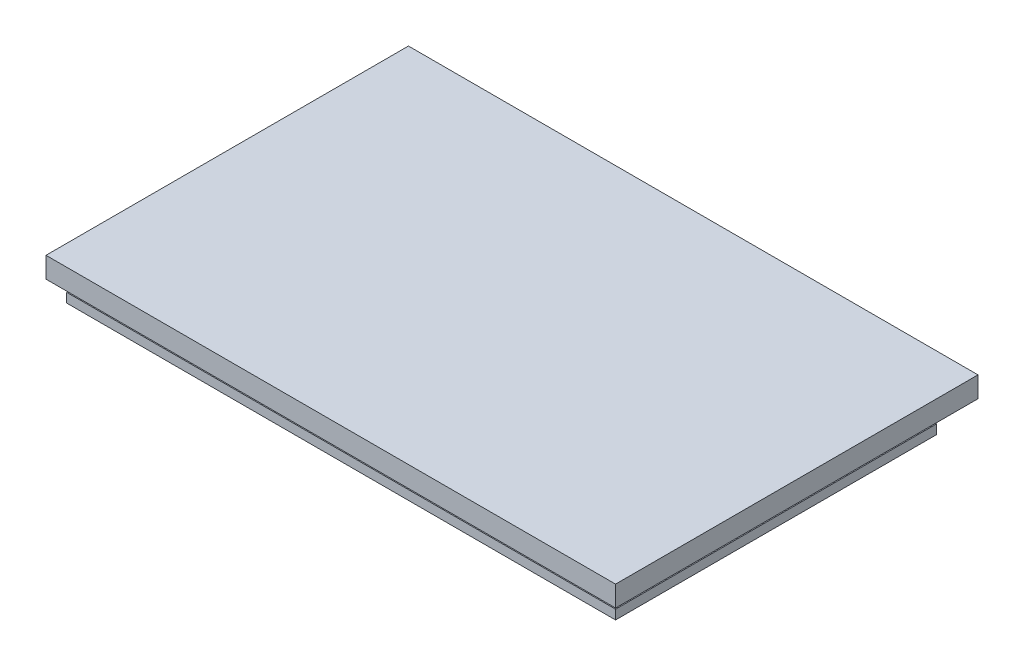
ISO-10303-21;
HEADER;
FILE_DESCRIPTION(('STEP AP214'),'2;1');
FILE_NAME('part.step','',(''),(''),'','','');
FILE_SCHEMA(('AUTOMOTIVE_DESIGN { 1 0 10303 214 1 1 1 1 }'));
ENDSEC;
DATA;
#1=APPLICATION_CONTEXT('core data for automotive mechanical design processes');
#2=APPLICATION_PROTOCOL_DEFINITION('international standard','automotive_design',2000,#1);
#3=PRODUCT_CONTEXT('',#1,'mechanical');
#4=PRODUCT('Part','Part','',(#3));
#5=PRODUCT_RELATED_PRODUCT_CATEGORY('part','',(#4));
#6=PRODUCT_DEFINITION_FORMATION('','',#4);
#7=PRODUCT_DEFINITION_CONTEXT('part definition',#1,'design');
#8=PRODUCT_DEFINITION('design','',#6,#7);
#9=PRODUCT_DEFINITION_SHAPE('','',#8);
#10=(LENGTH_UNIT() NAMED_UNIT(*) SI_UNIT(.MILLI.,.METRE.));
#11=(NAMED_UNIT(*) PLANE_ANGLE_UNIT() SI_UNIT($,.RADIAN.));
#12=(NAMED_UNIT(*) SI_UNIT($,.STERADIAN.) SOLID_ANGLE_UNIT());
#13=UNCERTAINTY_MEASURE_WITH_UNIT(LENGTH_MEASURE(1.E-05),#10,'distance_accuracy_value','');
#14=(GEOMETRIC_REPRESENTATION_CONTEXT(3) GLOBAL_UNCERTAINTY_ASSIGNED_CONTEXT((#13)) GLOBAL_UNIT_ASSIGNED_CONTEXT((#10,
#11,#12)) REPRESENTATION_CONTEXT('',''));
#15=CARTESIAN_POINT('',(0.,0.,0.));
#16=DIRECTION('',(0.,0.,1.));
#17=DIRECTION('',(1.,0.,0.));
#18=AXIS2_PLACEMENT_3D('',#15,#16,#17);
#19=CARTESIAN_POINT('',(4.92679663840367,2.286,-27.3028437938881));
#20=DIRECTION('',(1.,0.,0.));
#21=DIRECTION('',(0.,0.,-1.));
#22=AXIS2_PLACEMENT_3D('',#19,#20,#21);
#23=PLANE('',#22);
#24=DIRECTION('',(0.,0.,1.));
#25=VECTOR('',#24,1.);
#26=CARTESIAN_POINT('',(4.92679663840367,0.,-27.3028437938881));
#27=LINE('',#26,#25);
#28=CARTESIAN_POINT('',(4.92679663840367,0.,-27.3028437938881));
#29=VERTEX_POINT('',#28);
#30=CARTESIAN_POINT('',(4.92679663840368,0.,51.4371562061119));
#31=VERTEX_POINT('',#30);
#32=EDGE_CURVE('E197',#29,#31,#27,.T.);
#33=ORIENTED_EDGE('',*,*,#32,.T.);
#34=DIRECTION('',(0.,-1.,0.));
#35=VECTOR('',#34,1.);
#36=CARTESIAN_POINT('',(4.92679663840368,2.286,51.4371562061119));
#37=LINE('',#36,#35);
#38=CARTESIAN_POINT('',(4.92679663840368,2.286,51.4371562061119));
#39=VERTEX_POINT('',#38);
#40=EDGE_CURVE('E11',#39,#31,#37,.T.);
#41=ORIENTED_EDGE('',*,*,#40,.F.);
#42=DIRECTION('',(0.,0.,1.));
#43=VECTOR('',#42,1.);
#44=CARTESIAN_POINT('',(4.92679663840367,2.286,-27.3028437938881));
#45=LINE('',#44,#43);
#46=CARTESIAN_POINT('',(4.92679663840368,2.286,46.3571562061119));
#47=VERTEX_POINT('',#46);
#48=EDGE_CURVE('E202',#47,#39,#45,.T.);
#49=ORIENTED_EDGE('',*,*,#48,.F.);
#50=DIRECTION('',(0.,-1.,0.));
#51=VECTOR('',#50,1.);
#52=CARTESIAN_POINT('',(4.92679663840368,7.62,46.3571562061119));
#53=LINE('',#52,#51);
#54=CARTESIAN_POINT('',(4.92679663840368,7.62,46.3571562061119));
#55=VERTEX_POINT('',#54);
#56=EDGE_CURVE('E193',#55,#47,#53,.T.);
#57=ORIENTED_EDGE('',*,*,#56,.F.);
#58=DIRECTION('',(0.,0.,1.));
#59=VECTOR('',#58,1.);
#60=CARTESIAN_POINT('',(4.92679663840366,7.62,-32.3828437938881));
#61=LINE('',#60,#59);
#62=CARTESIAN_POINT('',(4.92679663840367,7.62,56.5171562061119));
#63=VERTEX_POINT('',#62);
#64=EDGE_CURVE('E153',#55,#63,#61,.T.);
#65=ORIENTED_EDGE('',*,*,#64,.T.);
#66=DIRECTION('',(0.,-1.,0.));
#67=VECTOR('',#66,1.);
#68=CARTESIAN_POINT('',(4.92679663840367,12.7,56.5171562061119));
#69=LINE('',#68,#67);
#70=CARTESIAN_POINT('',(4.92679663840367,12.7,56.5171562061119));
#71=VERTEX_POINT('',#70);
#72=EDGE_CURVE('E131',#71,#63,#69,.T.);
#73=ORIENTED_EDGE('',*,*,#72,.F.);
#74=DIRECTION('',(0.,0.,1.));
#75=VECTOR('',#74,1.);
#76=CARTESIAN_POINT('',(4.92679663840366,12.7,-32.3828437938881));
#77=LINE('',#76,#75);
#78=CARTESIAN_POINT('',(4.92679663840366,12.7,-32.3828437938881));
#79=VERTEX_POINT('',#78);
#80=EDGE_CURVE('E138',#79,#71,#77,.T.);
#81=ORIENTED_EDGE('',*,*,#80,.F.);
#82=DIRECTION('',(0.,-1.,0.));
#83=VECTOR('',#82,1.);
#84=CARTESIAN_POINT('',(4.92679663840366,12.7,-32.3828437938881));
#85=LINE('',#84,#83);
#86=CARTESIAN_POINT('',(4.92679663840366,7.62,-32.3828437938881));
#87=VERTEX_POINT('',#86);
#88=EDGE_CURVE('E277',#79,#87,#85,.T.);
#89=ORIENTED_EDGE('',*,*,#88,.T.);
#90=CARTESIAN_POINT('',(4.92679663840366,7.62,-22.2228437938881));
#91=VERTEX_POINT('',#90);
#92=EDGE_CURVE('E264',#87,#91,#61,.T.);
#93=ORIENTED_EDGE('',*,*,#92,.T.);
#94=DIRECTION('',(0.,-1.,0.));
#95=VECTOR('',#94,1.);
#96=CARTESIAN_POINT('',(4.92679663840367,7.62,-22.2228437938881));
#97=LINE('',#96,#95);
#98=CARTESIAN_POINT('',(4.92679663840368,2.286,-22.2228437938881));
#99=VERTEX_POINT('',#98);
#100=EDGE_CURVE('E176',#91,#99,#97,.T.);
#101=ORIENTED_EDGE('',*,*,#100,.T.);
#102=CARTESIAN_POINT('',(4.92679663840367,2.286,-27.3028437938881));
#103=VERTEX_POINT('',#102);
#104=EDGE_CURVE('E198',#103,#99,#45,.T.);
#105=ORIENTED_EDGE('',*,*,#104,.F.);
#106=DIRECTION('',(0.,-1.,0.));
#107=VECTOR('',#106,1.);
#108=CARTESIAN_POINT('',(4.92679663840367,2.286,-27.3028437938881));
#109=LINE('',#108,#107);
#110=EDGE_CURVE('E211',#103,#29,#109,.T.);
#111=ORIENTED_EDGE('',*,*,#110,.T.);
#112=EDGE_LOOP('',(#33,#41,#49,#57,#65,#73,#81,#89,#93,#101,#105,#111));
#113=FACE_BOUND('',#112,.T.);
#114=ADVANCED_FACE('F39',(#113),#23,.F.);
#115=CARTESIAN_POINT('',(4.92679663840368,2.286,51.4371562061119));
#116=DIRECTION('',(0.,0.,-1.));
#117=DIRECTION('',(-1.,0.,0.));
#118=AXIS2_PLACEMENT_3D('',#115,#116,#117);
#119=PLANE('',#118);
#120=DIRECTION('',(1.,0.,0.));
#121=VECTOR('',#120,1.);
#122=CARTESIAN_POINT('',(4.92679663840368,0.,51.4371562061119));
#123=LINE('',#122,#121);
#124=CARTESIAN_POINT('',(139.546796638404,0.,51.4371562061119));
#125=VERTEX_POINT('',#124);
#126=EDGE_CURVE('E214',#31,#125,#123,.T.);
#127=ORIENTED_EDGE('',*,*,#126,.T.);
#128=DIRECTION('',(0.,-1.,0.));
#129=VECTOR('',#128,1.);
#130=CARTESIAN_POINT('',(139.546796638404,2.286,51.4371562061119));
#131=LINE('',#130,#129);
#132=CARTESIAN_POINT('',(139.546796638404,2.286,51.4371562061119));
#133=VERTEX_POINT('',#132);
#134=EDGE_CURVE('E47',#133,#125,#131,.T.);
#135=ORIENTED_EDGE('',*,*,#134,.F.);
#136=DIRECTION('',(1.,0.,0.));
#137=VECTOR('',#136,1.);
#138=CARTESIAN_POINT('',(4.92679663840368,2.286,51.4371562061119));
#139=LINE('',#138,#137);
#140=EDGE_CURVE('E201',#39,#133,#139,.T.);
#141=ORIENTED_EDGE('',*,*,#140,.F.);
#142=ORIENTED_EDGE('',*,*,#40,.T.);
#143=EDGE_LOOP('',(#127,#135,#141,#142));
#144=FACE_BOUND('',#143,.T.);
#145=ADVANCED_FACE('F299',(#144),#119,.F.);
#146=CARTESIAN_POINT('',(139.546796638404,2.286,-27.3028437938881));
#147=DIRECTION('',(-1.,0.,0.));
#148=DIRECTION('',(0.,0.,1.));
#149=AXIS2_PLACEMENT_3D('',#146,#147,#148);
#150=PLANE('',#149);
#151=DIRECTION('',(0.,0.,-1.));
#152=VECTOR('',#151,1.);
#153=CARTESIAN_POINT('',(139.546796638404,0.,-27.3028437938881));
#154=LINE('',#153,#152);
#155=CARTESIAN_POINT('',(139.546796638404,0.,-27.3028437938881));
#156=VERTEX_POINT('',#155);
#157=EDGE_CURVE('E217',#125,#156,#154,.T.);
#158=ORIENTED_EDGE('',*,*,#157,.T.);
#159=DIRECTION('',(0.,-1.,0.));
#160=VECTOR('',#159,1.);
#161=CARTESIAN_POINT('',(139.546796638404,2.286,-27.3028437938881));
#162=LINE('',#161,#160);
#163=CARTESIAN_POINT('',(139.546796638404,2.286,-27.3028437938881));
#164=VERTEX_POINT('',#163);
#165=EDGE_CURVE('E226',#164,#156,#162,.T.);
#166=ORIENTED_EDGE('',*,*,#165,.F.);
#167=DIRECTION('',(0.,0.,-1.));
#168=VECTOR('',#167,1.);
#169=CARTESIAN_POINT('',(139.546796638404,2.286,-27.3028437938881));
#170=LINE('',#169,#168);
#171=EDGE_CURVE('E205',#133,#164,#170,.T.);
#172=ORIENTED_EDGE('',*,*,#171,.F.);
#173=ORIENTED_EDGE('',*,*,#134,.T.);
#174=EDGE_LOOP('',(#158,#166,#172,#173));
#175=FACE_BOUND('',#174,.T.);
#176=ADVANCED_FACE('F235',(#175),#150,.F.);
#177=CARTESIAN_POINT('',(4.92679663840367,2.286,-27.3028437938881));
#178=DIRECTION('',(0.,0.,1.));
#179=DIRECTION('',(1.,0.,0.));
#180=AXIS2_PLACEMENT_3D('',#177,#178,#179);
#181=PLANE('',#180);
#182=DIRECTION('',(-1.,0.,0.));
#183=VECTOR('',#182,1.);
#184=CARTESIAN_POINT('',(4.92679663840367,0.,-27.3028437938881));
#185=LINE('',#184,#183);
#186=EDGE_CURVE('E220',#156,#29,#185,.T.);
#187=ORIENTED_EDGE('',*,*,#186,.T.);
#188=ORIENTED_EDGE('',*,*,#110,.F.);
#189=DIRECTION('',(-1.,0.,0.));
#190=VECTOR('',#189,1.);
#191=CARTESIAN_POINT('',(4.92679663840367,2.286,-27.3028437938881));
#192=LINE('',#191,#190);
#193=EDGE_CURVE('E208',#164,#103,#192,.T.);
#194=ORIENTED_EDGE('',*,*,#193,.F.);
#195=ORIENTED_EDGE('',*,*,#165,.T.);
#196=EDGE_LOOP('',(#187,#188,#194,#195));
#197=FACE_BOUND('',#196,.T.);
#198=ADVANCED_FACE('F245',(#197),#181,.F.);
#199=CARTESIAN_POINT('',(0.,2.286,0.));
#200=DIRECTION('',(0.,1.,0.));
#201=DIRECTION('',(0.,0.,1.));
#202=AXIS2_PLACEMENT_3D('',#199,#200,#201);
#203=PLANE('',#202);
#204=DIRECTION('',(-1.,0.,0.));
#205=VECTOR('',#204,1.);
#206=CARTESIAN_POINT('',(4.92679663840367,2.286,-22.2228437938881));
#207=LINE('',#206,#205);
#208=CARTESIAN_POINT('',(134.466796638404,2.286,-22.2228437938881));
#209=VERTEX_POINT('',#208);
#210=EDGE_CURVE('E54',#209,#99,#207,.T.);
#211=ORIENTED_EDGE('',*,*,#210,.F.);
#212=DIRECTION('',(0.,0.,-1.));
#213=VECTOR('',#212,1.);
#214=CARTESIAN_POINT('',(134.466796638404,2.286,-22.2228437938881));
#215=LINE('',#214,#213);
#216=CARTESIAN_POINT('',(134.466796638404,2.286,46.3571562061119));
#217=VERTEX_POINT('',#216);
#218=EDGE_CURVE('E159',#217,#209,#215,.T.);
#219=ORIENTED_EDGE('',*,*,#218,.F.);
#220=DIRECTION('',(1.,0.,0.));
#221=VECTOR('',#220,1.);
#222=CARTESIAN_POINT('',(4.92679663840368,2.286,46.3571562061119));
#223=LINE('',#222,#221);
#224=EDGE_CURVE('E60',#47,#217,#223,.T.);
#225=ORIENTED_EDGE('',*,*,#224,.F.);
#226=ORIENTED_EDGE('',*,*,#48,.T.);
#227=ORIENTED_EDGE('',*,*,#140,.T.);
#228=ORIENTED_EDGE('',*,*,#171,.T.);
#229=ORIENTED_EDGE('',*,*,#193,.T.);
#230=ORIENTED_EDGE('',*,*,#104,.T.);
#231=EDGE_LOOP('',(#211,#219,#225,#226,#227,#228,#229,#230));
#232=FACE_BOUND('',#231,.T.);
#233=ADVANCED_FACE('F250',(#232),#203,.T.);
#234=CARTESIAN_POINT('',(0.,0.,0.));
#235=DIRECTION('',(0.,1.,0.));
#236=DIRECTION('',(0.,0.,1.));
#237=AXIS2_PLACEMENT_3D('',#234,#235,#236);
#238=PLANE('',#237);
#239=ORIENTED_EDGE('',*,*,#32,.F.);
#240=ORIENTED_EDGE('',*,*,#186,.F.);
#241=ORIENTED_EDGE('',*,*,#157,.F.);
#242=ORIENTED_EDGE('',*,*,#126,.F.);
#243=EDGE_LOOP('',(#239,#240,#241,#242));
#244=FACE_BOUND('',#243,.T.);
#245=ADVANCED_FACE('F242',(#244),#238,.F.);
#246=CARTESIAN_POINT('',(4.92679663840368,7.62,46.3571562061119));
#247=DIRECTION('',(0.,0.,-1.));
#248=DIRECTION('',(-1.,0.,0.));
#249=AXIS2_PLACEMENT_3D('',#246,#247,#248);
#250=PLANE('',#249);
#251=ORIENTED_EDGE('',*,*,#224,.T.);
#252=DIRECTION('',(0.,-1.,0.));
#253=VECTOR('',#252,1.);
#254=CARTESIAN_POINT('',(134.466796638404,7.62,46.3571562061119));
#255=LINE('',#254,#253);
#256=CARTESIAN_POINT('',(134.466796638404,7.62,46.3571562061119));
#257=VERTEX_POINT('',#256);
#258=EDGE_CURVE('E189',#257,#217,#255,.T.);
#259=ORIENTED_EDGE('',*,*,#258,.F.);
#260=DIRECTION('',(1.,0.,0.));
#261=VECTOR('',#260,1.);
#262=CARTESIAN_POINT('',(4.92679663840368,7.62,46.3571562061119));
#263=LINE('',#262,#261);
#264=EDGE_CURVE('E165',#55,#257,#263,.T.);
#265=ORIENTED_EDGE('',*,*,#264,.F.);
#266=ORIENTED_EDGE('',*,*,#56,.T.);
#267=EDGE_LOOP('',(#251,#259,#265,#266));
#268=FACE_BOUND('',#267,.T.);
#269=ADVANCED_FACE('F258',(#268),#250,.F.);
#270=CARTESIAN_POINT('',(134.466796638404,7.62,-22.2228437938881));
#271=DIRECTION('',(-1.,0.,0.));
#272=DIRECTION('',(0.,0.,1.));
#273=AXIS2_PLACEMENT_3D('',#270,#271,#272);
#274=PLANE('',#273);
#275=ORIENTED_EDGE('',*,*,#218,.T.);
#276=DIRECTION('',(0.,-1.,0.));
#277=VECTOR('',#276,1.);
#278=CARTESIAN_POINT('',(134.466796638404,7.62,-22.2228437938881));
#279=LINE('',#278,#277);
#280=CARTESIAN_POINT('',(134.466796638404,7.62,-22.2228437938881));
#281=VERTEX_POINT('',#280);
#282=EDGE_CURVE('E185',#281,#209,#279,.T.);
#283=ORIENTED_EDGE('',*,*,#282,.F.);
#284=DIRECTION('',(0.,0.,-1.));
#285=VECTOR('',#284,1.);
#286=CARTESIAN_POINT('',(134.466796638404,7.62,-22.2228437938881));
#287=LINE('',#286,#285);
#288=EDGE_CURVE('E169',#257,#281,#287,.T.);
#289=ORIENTED_EDGE('',*,*,#288,.F.);
#290=ORIENTED_EDGE('',*,*,#258,.T.);
#291=EDGE_LOOP('',(#275,#283,#289,#290));
#292=FACE_BOUND('',#291,.T.);
#293=ADVANCED_FACE('F256',(#292),#274,.F.);
#294=CARTESIAN_POINT('',(4.92679663840367,7.62,-22.2228437938881));
#295=DIRECTION('',(0.,0.,1.));
#296=DIRECTION('',(1.,0.,0.));
#297=AXIS2_PLACEMENT_3D('',#294,#295,#296);
#298=PLANE('',#297);
#299=ORIENTED_EDGE('',*,*,#210,.T.);
#300=ORIENTED_EDGE('',*,*,#100,.F.);
#301=DIRECTION('',(-1.,0.,0.));
#302=VECTOR('',#301,1.);
#303=CARTESIAN_POINT('',(4.92679663840367,7.62,-22.2228437938881));
#304=LINE('',#303,#302);
#305=EDGE_CURVE('E173',#281,#91,#304,.T.);
#306=ORIENTED_EDGE('',*,*,#305,.F.);
#307=ORIENTED_EDGE('',*,*,#282,.T.);
#308=EDGE_LOOP('',(#299,#300,#306,#307));
#309=FACE_BOUND('',#308,.T.);
#310=ADVANCED_FACE('F252',(#309),#298,.F.);
#311=CARTESIAN_POINT('',(0.,7.62,0.));
#312=DIRECTION('',(0.,1.,0.));
#313=DIRECTION('',(0.,0.,1.));
#314=AXIS2_PLACEMENT_3D('',#311,#312,#313);
#315=PLANE('',#314);
#316=ORIENTED_EDGE('',*,*,#64,.F.);
#317=ORIENTED_EDGE('',*,*,#264,.T.);
#318=ORIENTED_EDGE('',*,*,#288,.T.);
#319=ORIENTED_EDGE('',*,*,#305,.T.);
#320=ORIENTED_EDGE('',*,*,#92,.F.);
#321=DIRECTION('',(-1.,0.,0.));
#322=VECTOR('',#321,1.);
#323=CARTESIAN_POINT('',(4.92679663840366,7.62,-32.3828437938881));
#324=LINE('',#323,#322);
#325=CARTESIAN_POINT('',(144.626796638404,7.62,-32.3828437938882));
#326=VERTEX_POINT('',#325);
#327=EDGE_CURVE('E148',#326,#87,#324,.T.);
#328=ORIENTED_EDGE('',*,*,#327,.F.);
#329=DIRECTION('',(0.,0.,-1.));
#330=VECTOR('',#329,1.);
#331=CARTESIAN_POINT('',(144.626796638404,7.62,-32.3828437938882));
#332=LINE('',#331,#330);
#333=CARTESIAN_POINT('',(144.626796638404,7.62,56.5171562061118));
#334=VERTEX_POINT('',#333);
#335=EDGE_CURVE('E272',#334,#326,#332,.T.);
#336=ORIENTED_EDGE('',*,*,#335,.F.);
#337=DIRECTION('',(1.,0.,0.));
#338=VECTOR('',#337,1.);
#339=CARTESIAN_POINT('',(4.92679663840367,7.62,56.5171562061119));
#340=LINE('',#339,#338);
#341=EDGE_CURVE('E262',#63,#334,#340,.T.);
#342=ORIENTED_EDGE('',*,*,#341,.F.);
#343=EDGE_LOOP('',(#316,#317,#318,#319,#320,#328,#336,#342));
#344=FACE_BOUND('',#343,.T.);
#345=ADVANCED_FACE('F260',(#344),#315,.F.);
#346=CARTESIAN_POINT('',(4.92679663840367,12.7,56.5171562061119));
#347=DIRECTION('',(0.,0.,-1.));
#348=DIRECTION('',(-1.,0.,0.));
#349=AXIS2_PLACEMENT_3D('',#346,#347,#348);
#350=PLANE('',#349);
#351=ORIENTED_EDGE('',*,*,#341,.T.);
#352=DIRECTION('',(0.,-1.,0.));
#353=VECTOR('',#352,1.);
#354=CARTESIAN_POINT('',(144.626796638404,12.7,56.5171562061118));
#355=LINE('',#354,#353);
#356=CARTESIAN_POINT('',(144.626796638404,12.7,56.5171562061118));
#357=VERTEX_POINT('',#356);
#358=EDGE_CURVE('E133',#357,#334,#355,.T.);
#359=ORIENTED_EDGE('',*,*,#358,.F.);
#360=DIRECTION('',(1.,0.,0.));
#361=VECTOR('',#360,1.);
#362=CARTESIAN_POINT('',(4.92679663840367,12.7,56.5171562061119));
#363=LINE('',#362,#361);
#364=EDGE_CURVE('E127',#71,#357,#363,.T.);
#365=ORIENTED_EDGE('',*,*,#364,.F.);
#366=ORIENTED_EDGE('',*,*,#72,.T.);
#367=EDGE_LOOP('',(#351,#359,#365,#366));
#368=FACE_BOUND('',#367,.T.);
#369=ADVANCED_FACE('F129',(#368),#350,.F.);
#370=CARTESIAN_POINT('',(144.626796638404,12.7,-32.3828437938882));
#371=DIRECTION('',(-1.,0.,0.));
#372=DIRECTION('',(0.,0.,1.));
#373=AXIS2_PLACEMENT_3D('',#370,#371,#372);
#374=PLANE('',#373);
#375=ORIENTED_EDGE('',*,*,#335,.T.);
#376=DIRECTION('',(0.,-1.,0.));
#377=VECTOR('',#376,1.);
#378=CARTESIAN_POINT('',(144.626796638404,12.7,-32.3828437938882));
#379=LINE('',#378,#377);
#380=CARTESIAN_POINT('',(144.626796638404,12.7,-32.3828437938882));
#381=VERTEX_POINT('',#380);
#382=EDGE_CURVE('E161',#381,#326,#379,.T.);
#383=ORIENTED_EDGE('',*,*,#382,.F.);
#384=DIRECTION('',(0.,0.,-1.));
#385=VECTOR('',#384,1.);
#386=CARTESIAN_POINT('',(144.626796638404,12.7,-32.3828437938882));
#387=LINE('',#386,#385);
#388=EDGE_CURVE('E137',#357,#381,#387,.T.);
#389=ORIENTED_EDGE('',*,*,#388,.F.);
#390=ORIENTED_EDGE('',*,*,#358,.T.);
#391=EDGE_LOOP('',(#375,#383,#389,#390));
#392=FACE_BOUND('',#391,.T.);
#393=ADVANCED_FACE('F287',(#392),#374,.F.);
#394=CARTESIAN_POINT('',(4.92679663840366,12.7,-32.3828437938881));
#395=DIRECTION('',(0.,0.,1.));
#396=DIRECTION('',(1.,0.,0.));
#397=AXIS2_PLACEMENT_3D('',#394,#395,#396);
#398=PLANE('',#397);
#399=ORIENTED_EDGE('',*,*,#327,.T.);
#400=ORIENTED_EDGE('',*,*,#88,.F.);
#401=DIRECTION('',(-1.,0.,0.));
#402=VECTOR('',#401,1.);
#403=CARTESIAN_POINT('',(4.92679663840366,12.7,-32.3828437938881));
#404=LINE('',#403,#402);
#405=EDGE_CURVE('E143',#381,#79,#404,.T.);
#406=ORIENTED_EDGE('',*,*,#405,.F.);
#407=ORIENTED_EDGE('',*,*,#382,.T.);
#408=EDGE_LOOP('',(#399,#400,#406,#407));
#409=FACE_BOUND('',#408,.T.);
#410=ADVANCED_FACE('F284',(#409),#398,.F.);
#411=CARTESIAN_POINT('',(0.,12.7,0.));
#412=DIRECTION('',(0.,1.,0.));
#413=DIRECTION('',(0.,0.,1.));
#414=AXIS2_PLACEMENT_3D('',#411,#412,#413);
#415=PLANE('',#414);
#416=ORIENTED_EDGE('',*,*,#80,.T.);
#417=ORIENTED_EDGE('',*,*,#364,.T.);
#418=ORIENTED_EDGE('',*,*,#388,.T.);
#419=ORIENTED_EDGE('',*,*,#405,.T.);
#420=EDGE_LOOP('',(#416,#417,#418,#419));
#421=FACE_BOUND('',#420,.T.);
#422=ADVANCED_FACE('F141',(#421),#415,.T.);
#423=CLOSED_SHELL('',(#114,#145,#176,#198,#233,#245,#269,#293,#310,#345,#369,#393,#410,#422));
#424=MANIFOLD_SOLID_BREP('B2',#423);
#425=ADVANCED_BREP_SHAPE_REPRESENTATION('',(#18,#424),#14);
#426=SHAPE_DEFINITION_REPRESENTATION(#9,#425);
ENDSEC;
END-ISO-10303-21;
